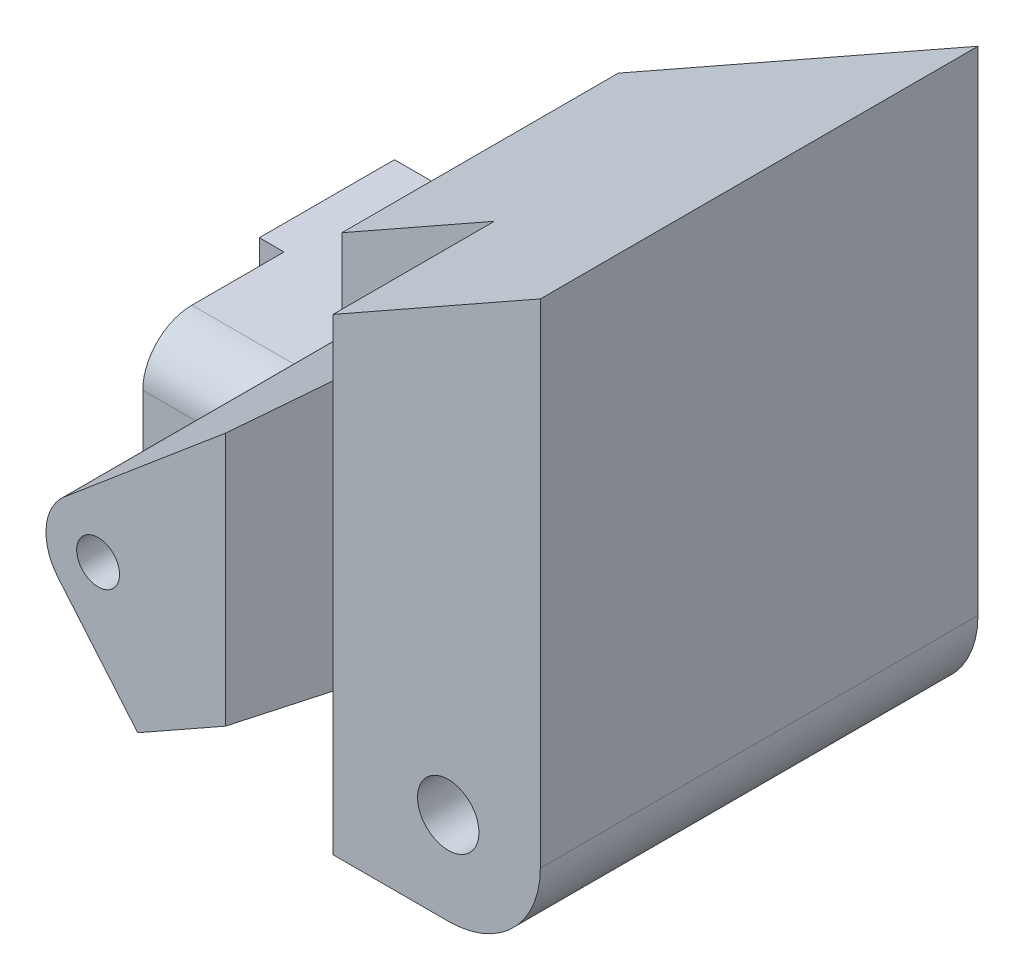
ISO-10303-21;
HEADER;
FILE_DESCRIPTION(('STEP AP214'),'2;1');
FILE_NAME('part.step','',(''),(''),'','','');
FILE_SCHEMA(('AUTOMOTIVE_DESIGN { 1 0 10303 214 1 1 1 1 }'));
ENDSEC;
DATA;
#1=APPLICATION_CONTEXT('core data for automotive mechanical design processes');
#2=APPLICATION_PROTOCOL_DEFINITION('international standard','automotive_design',2000,#1);
#3=PRODUCT_CONTEXT('',#1,'mechanical');
#4=PRODUCT('Part','Part','',(#3));
#5=PRODUCT_RELATED_PRODUCT_CATEGORY('part','',(#4));
#6=PRODUCT_DEFINITION_FORMATION('','',#4);
#7=PRODUCT_DEFINITION_CONTEXT('part definition',#1,'design');
#8=PRODUCT_DEFINITION('design','',#6,#7);
#9=PRODUCT_DEFINITION_SHAPE('','',#8);
#10=(LENGTH_UNIT() NAMED_UNIT(*) SI_UNIT(.MILLI.,.METRE.));
#11=(NAMED_UNIT(*) PLANE_ANGLE_UNIT() SI_UNIT($,.RADIAN.));
#12=(NAMED_UNIT(*) SI_UNIT($,.STERADIAN.) SOLID_ANGLE_UNIT());
#13=UNCERTAINTY_MEASURE_WITH_UNIT(LENGTH_MEASURE(1.E-05),#10,'distance_accuracy_value','');
#14=(GEOMETRIC_REPRESENTATION_CONTEXT(3) GLOBAL_UNCERTAINTY_ASSIGNED_CONTEXT((#13)) GLOBAL_UNIT_ASSIGNED_CONTEXT((#10,
#11,#12)) REPRESENTATION_CONTEXT('',''));
#15=CARTESIAN_POINT('',(0.,0.,0.));
#16=DIRECTION('',(0.,0.,1.));
#17=DIRECTION('',(1.,0.,0.));
#18=AXIS2_PLACEMENT_3D('',#15,#16,#17);
#19=CARTESIAN_POINT('',(-16.,0.,9.));
#20=DIRECTION('',(1.,0.,0.));
#21=DIRECTION('',(0.,0.,-1.));
#22=AXIS2_PLACEMENT_3D('',#19,#20,#21);
#23=PLANE('',#22);
#24=DIRECTION('',(0.,-1.,0.));
#25=VECTOR('',#24,1.);
#26=CARTESIAN_POINT('',(-16.,0.,-0.2));
#27=LINE('',#26,#25);
#28=CARTESIAN_POINT('',(-16.,-9.35000000000001,-0.2));
#29=VERTEX_POINT('',#28);
#30=CARTESIAN_POINT('',(-16.,-22.05,-0.200000000000001));
#31=VERTEX_POINT('',#30);
#32=EDGE_CURVE('E193',#29,#31,#27,.T.);
#33=ORIENTED_EDGE('',*,*,#32,.F.);
#34=DIRECTION('',(0.,0.,-1.));
#35=VECTOR('',#34,1.);
#36=CARTESIAN_POINT('',(-16.,-9.35000000000001,9.));
#37=LINE('',#36,#35);
#38=CARTESIAN_POINT('',(-16.,-9.35000000000001,-9.));
#39=VERTEX_POINT('',#38);
#40=EDGE_CURVE('E317',#29,#39,#37,.T.);
#41=ORIENTED_EDGE('',*,*,#40,.T.);
#42=DIRECTION('',(0.,-1.,0.));
#43=VECTOR('',#42,1.);
#44=CARTESIAN_POINT('',(-16.,0.,-9.));
#45=LINE('',#44,#43);
#46=CARTESIAN_POINT('',(-16.,-22.05,-9.));
#47=VERTEX_POINT('',#46);
#48=EDGE_CURVE('E288',#39,#47,#45,.T.);
#49=ORIENTED_EDGE('',*,*,#48,.T.);
#50=DIRECTION('',(0.,0.,-1.));
#51=VECTOR('',#50,1.);
#52=CARTESIAN_POINT('',(-16.,-22.05,9.));
#53=LINE('',#52,#51);
#54=EDGE_CURVE('E315',#31,#47,#53,.T.);
#55=ORIENTED_EDGE('',*,*,#54,.F.);
#56=EDGE_LOOP('',(#33,#41,#49,#55));
#57=FACE_BOUND('',#56,.T.);
#58=ADVANCED_FACE('F37',(#57),#23,.F.);
#59=CARTESIAN_POINT('',(0.,0.,9.));
#60=DIRECTION('',(0.,0.,1.));
#61=DIRECTION('',(1.,0.,0.));
#62=AXIS2_PLACEMENT_3D('',#59,#60,#61);
#63=PLANE('',#62);
#64=DIRECTION('',(-0.644238518166647,0.764824641150142,0.));
#65=VECTOR('',#64,1.);
#66=CARTESIAN_POINT('',(-9.30641295802667,-7.83911680004175,9.));
#67=LINE('',#66,#65);
#68=CARTESIAN_POINT('',(-0.722784510357856,-18.0293962728321,9.));
#69=VERTEX_POINT('',#68);
#70=CARTESIAN_POINT('',(-5.33827144073282,-12.55,9.));
#71=VERTEX_POINT('',#70);
#72=EDGE_CURVE('E272',#69,#71,#67,.T.);
#73=ORIENTED_EDGE('',*,*,#72,.T.);
#74=DIRECTION('',(-1.,0.,0.));
#75=VECTOR('',#74,1.);
#76=CARTESIAN_POINT('',(-14.3916870159381,-12.55,9.));
#77=LINE('',#76,#75);
#78=CARTESIAN_POINT('',(-14.3916870159381,-12.55,9.));
#79=VERTEX_POINT('',#78);
#80=EDGE_CURVE('E330',#71,#79,#77,.T.);
#81=ORIENTED_EDGE('',*,*,#80,.T.);
#82=DIRECTION('',(0.,1.,0.));
#83=VECTOR('',#82,1.);
#84=CARTESIAN_POINT('',(-14.3916870159381,0.,9.));
#85=LINE('',#84,#83);
#86=CARTESIAN_POINT('',(-14.3916870159381,-18.85,9.));
#87=VERTEX_POINT('',#86);
#88=EDGE_CURVE('E205',#87,#79,#85,.T.);
#89=ORIENTED_EDGE('',*,*,#88,.F.);
#90=DIRECTION('',(1.,0.,0.));
#91=VECTOR('',#90,1.);
#92=CARTESIAN_POINT('',(8.5,-18.85,9.));
#93=LINE('',#92,#91);
#94=CARTESIAN_POINT('',(8.5,-18.85,9.));
#95=VERTEX_POINT('',#94);
#96=EDGE_CURVE('E184',#87,#95,#93,.T.);
#97=ORIENTED_EDGE('',*,*,#96,.T.);
#98=DIRECTION('',(0.,1.,0.));
#99=VECTOR('',#98,1.);
#100=CARTESIAN_POINT('',(8.5,0.,9.));
#101=LINE('',#100,#99);
#102=CARTESIAN_POINT('',(8.5,-12.8207309978882,9.));
#103=VERTEX_POINT('',#102);
#104=EDGE_CURVE('E230',#95,#103,#101,.T.);
#105=ORIENTED_EDGE('',*,*,#104,.T.);
#106=DIRECTION('',(-0.870733168126101,-0.491755782807974,0.));
#107=VECTOR('',#106,1.);
#108=CARTESIAN_POINT('',(7.54518594542443,-13.3599723522222,9.));
#109=LINE('',#108,#107);
#110=EDGE_CURVE('E269',#103,#69,#109,.T.);
#111=ORIENTED_EDGE('',*,*,#110,.T.);
#112=EDGE_LOOP('',(#73,#81,#89,#97,#105,#111));
#113=FACE_BOUND('',#112,.T.);
#114=ADVANCED_FACE('F368',(#113),#63,.T.);
#115=DIRECTION('',(0.764824641150142,0.644238518166647,0.));
#116=VECTOR('',#115,1.);
#117=CARTESIAN_POINT('',(1.22264353214617,-1.45149331242928,9.));
#118=LINE('',#117,#116);
#119=CARTESIAN_POINT('',(-1.42439386884653,-3.68118540260928,9.));
#120=VERTEX_POINT('',#119);
#121=CARTESIAN_POINT('',(8.5,4.67847831083101,9.));
#122=VERTEX_POINT('',#121);
#123=EDGE_CURVE('E264',#120,#122,#118,.T.);
#124=ORIENTED_EDGE('',*,*,#123,.T.);
#125=CARTESIAN_POINT('',(8.5,8.42573195678906,9.));
#126=VERTEX_POINT('',#125);
#127=EDGE_CURVE('E229',#122,#126,#101,.T.);
#128=ORIENTED_EDGE('',*,*,#127,.T.);
#129=DIRECTION('',(-0.870733168126101,-0.491755782807974,0.));
#130=VECTOR('',#129,1.);
#131=CARTESIAN_POINT('',(-1.55229603652309,2.74859125811062,9.));
#132=LINE('',#131,#130);
#133=CARTESIAN_POINT('',(-1.42439386884653,2.8208253625309,9.));
#134=VERTEX_POINT('',#133);
#135=EDGE_CURVE('E276',#126,#134,#132,.T.);
#136=ORIENTED_EDGE('',*,*,#135,.T.);
#137=DIRECTION('',(0.,-1.,0.));
#138=VECTOR('',#137,1.);
#139=CARTESIAN_POINT('',(-1.42439386884653,0.,9.));
#140=LINE('',#139,#138);
#141=EDGE_CURVE('E278',#134,#120,#140,.T.);
#142=ORIENTED_EDGE('',*,*,#141,.T.);
#143=EDGE_LOOP('',(#124,#128,#136,#142));
#144=FACE_BOUND('',#143,.T.);
#145=ADVANCED_FACE('F391',(#144),#63,.T.);
#146=CARTESIAN_POINT('',(0.,-9.35000000000001,9.));
#147=DIRECTION('',(0.,-1.,0.));
#148=DIRECTION('',(1.,0.,0.));
#149=AXIS2_PLACEMENT_3D('',#146,#147,#148);
#150=PLANE('',#149);
#151=DIRECTION('',(0.,0.,-1.));
#152=VECTOR('',#151,1.);
#153=CARTESIAN_POINT('',(-14.3916870159381,-9.35000000000001,23.));
#154=LINE('',#153,#152);
#155=CARTESIAN_POINT('',(-14.3916870159381,-9.35000000000001,5.8));
#156=VERTEX_POINT('',#155);
#157=CARTESIAN_POINT('',(-14.3916870159381,-9.35000000000001,-0.2));
#158=VERTEX_POINT('',#157);
#159=EDGE_CURVE('E198',#156,#158,#154,.T.);
#160=ORIENTED_EDGE('',*,*,#159,.F.);
#161=DIRECTION('',(-1.,0.,0.));
#162=VECTOR('',#161,1.);
#163=CARTESIAN_POINT('',(-6.67691057032904,-9.35000000000001,5.8));
#164=LINE('',#163,#162);
#165=CARTESIAN_POINT('',(-6.67691057032904,-9.35000000000001,5.8));
#166=VERTEX_POINT('',#165);
#167=EDGE_CURVE('E337',#156,#166,#164,.F.);
#168=ORIENTED_EDGE('',*,*,#167,.T.);
#169=DIRECTION('',(0.,0.,-1.));
#170=VECTOR('',#169,1.);
#171=CARTESIAN_POINT('',(-6.67691057032904,-9.35000000000001,23.));
#172=LINE('',#171,#170);
#173=CARTESIAN_POINT('',(-6.67691057032904,-9.35000000000001,-9.));
#174=VERTEX_POINT('',#173);
#175=EDGE_CURVE('E261',#174,#166,#172,.F.);
#176=ORIENTED_EDGE('',*,*,#175,.F.);
#177=DIRECTION('',(-1.,0.,0.));
#178=VECTOR('',#177,1.);
#179=CARTESIAN_POINT('',(0.,-9.35000000000001,-9.));
#180=LINE('',#179,#178);
#181=EDGE_CURVE('E285',#174,#39,#180,.T.);
#182=ORIENTED_EDGE('',*,*,#181,.T.);
#183=ORIENTED_EDGE('',*,*,#40,.F.);
#184=DIRECTION('',(-1.,0.,0.));
#185=VECTOR('',#184,1.);
#186=CARTESIAN_POINT('',(0.,-9.35000000000001,-0.2));
#187=LINE('',#186,#185);
#188=EDGE_CURVE('E199',#158,#29,#187,.T.);
#189=ORIENTED_EDGE('',*,*,#188,.F.);
#190=EDGE_LOOP('',(#160,#168,#176,#182,#183,#189));
#191=FACE_BOUND('',#190,.T.);
#192=ADVANCED_FACE('F387',(#191),#150,.F.);
#193=CARTESIAN_POINT('',(-1.42439386884653,0.,9.));
#194=DIRECTION('',(1.,0.,0.));
#195=DIRECTION('',(0.,0.,-1.));
#196=AXIS2_PLACEMENT_3D('',#193,#194,#195);
#197=PLANE('',#196);
#198=DIRECTION('',(0.,0.,-1.));
#199=VECTOR('',#198,1.);
#200=CARTESIAN_POINT('',(-1.42439386884653,-3.68118540260928,9.));
#201=LINE('',#200,#199);
#202=CARTESIAN_POINT('',(-1.42439386884653,-3.68118540260928,-9.));
#203=VERTEX_POINT('',#202);
#204=EDGE_CURVE('E267',#120,#203,#201,.T.);
#205=ORIENTED_EDGE('',*,*,#204,.F.);
#206=ORIENTED_EDGE('',*,*,#141,.F.);
#207=DIRECTION('',(0.,0.,-1.));
#208=VECTOR('',#207,1.);
#209=CARTESIAN_POINT('',(-1.42439386884653,2.8208253625309,9.));
#210=LINE('',#209,#208);
#211=CARTESIAN_POINT('',(-1.42439386884653,2.8208253625309,-9.));
#212=VERTEX_POINT('',#211);
#213=EDGE_CURVE('E282',#134,#212,#210,.T.);
#214=ORIENTED_EDGE('',*,*,#213,.T.);
#215=DIRECTION('',(0.,-1.,0.));
#216=VECTOR('',#215,1.);
#217=CARTESIAN_POINT('',(-1.42439386884653,0.,-9.));
#218=LINE('',#217,#216);
#219=EDGE_CURVE('E299',#212,#203,#218,.T.);
#220=ORIENTED_EDGE('',*,*,#219,.T.);
#221=EDGE_LOOP('',(#205,#206,#214,#220));
#222=FACE_BOUND('',#221,.T.);
#223=ADVANCED_FACE('F364',(#222),#197,.F.);
#224=CARTESIAN_POINT('',(-3.3,-9.7,9.));
#225=DIRECTION('',(0.,0.,-1.));
#226=DIRECTION('',(-1.,0.,0.));
#227=AXIS2_PLACEMENT_3D('',#224,#225,#226);
#228=CYLINDRICAL_SURFACE('',#227,1.395);
#229=CARTESIAN_POINT('',(-3.3,-9.7,-9.));
#230=DIRECTION('',(0.,0.,1.));
#231=DIRECTION('',(1.,0.,0.));
#232=AXIS2_PLACEMENT_3D('',#229,#230,#231);
#233=CIRCLE('',#232,1.395);
#234=CARTESIAN_POINT('',(-1.905,-9.7,-9.));
#235=VERTEX_POINT('',#234);
#236=EDGE_CURVE('E275',#235,#235,#233,.T.);
#237=ORIENTED_EDGE('',*,*,#236,.F.);
#238=EDGE_LOOP('',(#237));
#239=FACE_BOUND('',#238,.T.);
#240=CARTESIAN_POINT('',(-3.3,-9.7,23.));
#241=DIRECTION('',(0.,0.,1.));
#242=DIRECTION('',(1.,0.,0.));
#243=AXIS2_PLACEMENT_3D('',#240,#241,#242);
#244=CIRCLE('',#243,1.395);
#245=CARTESIAN_POINT('',(-1.905,-9.7,23.));
#246=VERTEX_POINT('',#245);
#247=EDGE_CURVE('E232',#246,#246,#244,.T.);
#248=ORIENTED_EDGE('',*,*,#247,.T.);
#249=EDGE_LOOP('',(#248));
#250=FACE_BOUND('',#249,.T.);
#251=ADVANCED_FACE('F361',(#239,#250),#228,.F.);
#252=CARTESIAN_POINT('',(0.,-22.05,9.));
#253=DIRECTION('',(0.,1.,0.));
#254=DIRECTION('',(0.,0.,1.));
#255=AXIS2_PLACEMENT_3D('',#252,#253,#254);
#256=PLANE('',#255);
#257=DIRECTION('',(0.,0.,-1.));
#258=VECTOR('',#257,1.);
#259=CARTESIAN_POINT('',(8.5,-22.05,19.5));
#260=LINE('',#259,#258);
#261=CARTESIAN_POINT('',(8.5,-22.05,19.5));
#262=VERTEX_POINT('',#261);
#263=CARTESIAN_POINT('',(8.5,-22.05,5.8));
#264=VERTEX_POINT('',#263);
#265=EDGE_CURVE('E60',#262,#264,#260,.T.);
#266=ORIENTED_EDGE('',*,*,#265,.T.);
#267=DIRECTION('',(1.,0.,0.));
#268=VECTOR('',#267,1.);
#269=CARTESIAN_POINT('',(-14.3916870159381,-22.05,5.8));
#270=LINE('',#269,#268);
#271=CARTESIAN_POINT('',(-14.3916870159381,-22.05,5.8));
#272=VERTEX_POINT('',#271);
#273=EDGE_CURVE('E180',#264,#272,#270,.F.);
#274=ORIENTED_EDGE('',*,*,#273,.T.);
#275=DIRECTION('',(0.,0.,-1.));
#276=VECTOR('',#275,1.);
#277=CARTESIAN_POINT('',(-14.3916870159381,-22.05,9.));
#278=LINE('',#277,#276);
#279=CARTESIAN_POINT('',(-14.3916870159381,-22.05,-0.2));
#280=VERTEX_POINT('',#279);
#281=EDGE_CURVE('E174',#272,#280,#278,.T.);
#282=ORIENTED_EDGE('',*,*,#281,.T.);
#283=DIRECTION('',(1.,0.,0.));
#284=VECTOR('',#283,1.);
#285=CARTESIAN_POINT('',(0.,-22.05,-0.2));
#286=LINE('',#285,#284);
#287=EDGE_CURVE('E177',#31,#280,#286,.T.);
#288=ORIENTED_EDGE('',*,*,#287,.F.);
#289=ORIENTED_EDGE('',*,*,#54,.T.);
#290=DIRECTION('',(1.,0.,0.));
#291=VECTOR('',#290,1.);
#292=CARTESIAN_POINT('',(0.,-22.05,-9.));
#293=LINE('',#292,#291);
#294=CARTESIAN_POINT('',(16.,-22.05,-9.));
#295=VERTEX_POINT('',#294);
#296=EDGE_CURVE('E291',#47,#295,#293,.T.);
#297=ORIENTED_EDGE('',*,*,#296,.T.);
#298=DIRECTION('',(0.,0.,-1.));
#299=VECTOR('',#298,1.);
#300=CARTESIAN_POINT('',(16.,-22.05,9.));
#301=LINE('',#300,#299);
#302=CARTESIAN_POINT('',(16.,-22.05,19.5));
#303=VERTEX_POINT('',#302);
#304=EDGE_CURVE('E312',#303,#295,#301,.T.);
#305=ORIENTED_EDGE('',*,*,#304,.F.);
#306=DIRECTION('',(1.,0.,0.));
#307=VECTOR('',#306,1.);
#308=CARTESIAN_POINT('',(0.,-22.05,19.5));
#309=LINE('',#308,#307);
#310=EDGE_CURVE('E222',#262,#303,#309,.T.);
#311=ORIENTED_EDGE('',*,*,#310,.F.);
#312=EDGE_LOOP('',(#266,#274,#282,#288,#289,#297,#305,#311));
#313=FACE_BOUND('',#312,.T.);
#314=ADVANCED_FACE('F176',(#313),#256,.F.);
#315=CARTESIAN_POINT('',(16.,-16.05,9.));
#316=DIRECTION('',(0.,0.,-1.));
#317=DIRECTION('',(-1.,0.,0.));
#318=AXIS2_PLACEMENT_3D('',#315,#316,#317);
#319=CYLINDRICAL_SURFACE('',#318,6.);
#320=CARTESIAN_POINT('',(16.,-16.05,-9.));
#321=DIRECTION('',(0.,0.,1.));
#322=DIRECTION('',(1.,0.,0.));
#323=AXIS2_PLACEMENT_3D('',#320,#321,#322);
#324=CIRCLE('',#323,6.);
#325=CARTESIAN_POINT('',(22.,-16.05,-9.));
#326=VERTEX_POINT('',#325);
#327=EDGE_CURVE('E293',#295,#326,#324,.T.);
#328=ORIENTED_EDGE('',*,*,#327,.T.);
#329=DIRECTION('',(0.,0.,-1.));
#330=VECTOR('',#329,1.);
#331=CARTESIAN_POINT('',(22.,-16.05,9.));
#332=LINE('',#331,#330);
#333=CARTESIAN_POINT('',(22.,-16.05,19.5));
#334=VERTEX_POINT('',#333);
#335=EDGE_CURVE('E309',#334,#326,#332,.T.);
#336=ORIENTED_EDGE('',*,*,#335,.F.);
#337=CARTESIAN_POINT('',(16.,-16.05,19.5));
#338=DIRECTION('',(0.,0.,1.));
#339=DIRECTION('',(1.,0.,0.));
#340=AXIS2_PLACEMENT_3D('',#337,#338,#339);
#341=CIRCLE('',#340,6.);
#342=EDGE_CURVE('E210',#303,#334,#341,.T.);
#343=ORIENTED_EDGE('',*,*,#342,.F.);
#344=ORIENTED_EDGE('',*,*,#304,.T.);
#345=EDGE_LOOP('',(#328,#336,#343,#344));
#346=FACE_BOUND('',#345,.T.);
#347=ADVANCED_FACE('F372',(#346),#319,.T.);
#348=CARTESIAN_POINT('',(22.,0.,9.));
#349=DIRECTION('',(-1.,0.,0.));
#350=DIRECTION('',(0.,0.,1.));
#351=AXIS2_PLACEMENT_3D('',#348,#349,#350);
#352=PLANE('',#351);
#353=DIRECTION('',(0.,1.,0.));
#354=VECTOR('',#353,1.);
#355=CARTESIAN_POINT('',(22.,0.,-9.));
#356=LINE('',#355,#354);
#357=CARTESIAN_POINT('',(22.,16.05,-9.));
#358=VERTEX_POINT('',#357);
#359=EDGE_CURVE('E295',#326,#358,#356,.T.);
#360=ORIENTED_EDGE('',*,*,#359,.T.);
#361=DIRECTION('',(0.,0.,-1.));
#362=VECTOR('',#361,1.);
#363=CARTESIAN_POINT('',(22.,16.05,9.));
#364=LINE('',#363,#362);
#365=CARTESIAN_POINT('',(22.,16.05,19.5));
#366=VERTEX_POINT('',#365);
#367=EDGE_CURVE('E306',#366,#358,#364,.T.);
#368=ORIENTED_EDGE('',*,*,#367,.F.);
#369=DIRECTION('',(0.,1.,0.));
#370=VECTOR('',#369,1.);
#371=CARTESIAN_POINT('',(22.,0.,19.5));
#372=LINE('',#371,#370);
#373=EDGE_CURVE('E213',#334,#366,#372,.T.);
#374=ORIENTED_EDGE('',*,*,#373,.F.);
#375=ORIENTED_EDGE('',*,*,#335,.T.);
#376=EDGE_LOOP('',(#360,#368,#374,#375));
#377=FACE_BOUND('',#376,.T.);
#378=ADVANCED_FACE('F375',(#377),#352,.F.);
#379=CARTESIAN_POINT('',(-1.55229603652309,2.74859125811062,9.));
#380=DIRECTION('',(0.491755782807974,-0.870733168126101,0.));
#381=DIRECTION('',(0.870733168126101,0.491755782807974,0.));
#382=AXIS2_PLACEMENT_3D('',#379,#380,#381);
#383=PLANE('',#382);
#384=DIRECTION('',(-0.870733168126101,-0.491755782807974,0.));
#385=VECTOR('',#384,1.);
#386=CARTESIAN_POINT('',(-1.55229603652309,2.74859125811062,-9.));
#387=LINE('',#386,#385);
#388=EDGE_CURVE('E297',#358,#212,#387,.T.);
#389=ORIENTED_EDGE('',*,*,#388,.T.);
#390=ORIENTED_EDGE('',*,*,#213,.F.);
#391=ORIENTED_EDGE('',*,*,#135,.F.);
#392=DIRECTION('',(0.,0.,-1.));
#393=VECTOR('',#392,1.);
#394=CARTESIAN_POINT('',(8.5,8.42573195678906,19.5));
#395=LINE('',#394,#393);
#396=CARTESIAN_POINT('',(8.5,8.42573195678906,19.5));
#397=VERTEX_POINT('',#396);
#398=EDGE_CURVE('E226',#397,#126,#395,.T.);
#399=ORIENTED_EDGE('',*,*,#398,.F.);
#400=DIRECTION('',(-0.870733168126101,-0.491755782807974,0.));
#401=VECTOR('',#400,1.);
#402=CARTESIAN_POINT('',(-1.55229603652309,2.74859125811062,19.5));
#403=LINE('',#402,#401);
#404=EDGE_CURVE('E216',#366,#397,#403,.T.);
#405=ORIENTED_EDGE('',*,*,#404,.F.);
#406=ORIENTED_EDGE('',*,*,#367,.T.);
#407=EDGE_LOOP('',(#389,#390,#391,#399,#405,#406));
#408=FACE_BOUND('',#407,.T.);
#409=ADVANCED_FACE('F379',(#408),#383,.F.);
#410=CARTESIAN_POINT('',(16.,-16.05,9.));
#411=DIRECTION('',(0.,0.,-1.));
#412=DIRECTION('',(-1.,0.,0.));
#413=AXIS2_PLACEMENT_3D('',#410,#411,#412);
#414=CYLINDRICAL_SURFACE('',#413,2.);
#415=CARTESIAN_POINT('',(16.,-16.05,-9.));
#416=DIRECTION('',(0.,0.,1.));
#417=DIRECTION('',(1.,0.,0.));
#418=AXIS2_PLACEMENT_3D('',#415,#416,#417);
#419=CIRCLE('',#418,2.);
#420=CARTESIAN_POINT('',(18.,-16.05,-9.));
#421=VERTEX_POINT('',#420);
#422=EDGE_CURVE('E279',#421,#421,#419,.T.);
#423=ORIENTED_EDGE('',*,*,#422,.F.);
#424=EDGE_LOOP('',(#423));
#425=FACE_BOUND('',#424,.T.);
#426=CARTESIAN_POINT('',(16.,-16.05,19.5));
#427=DIRECTION('',(0.,0.,1.));
#428=DIRECTION('',(1.,0.,0.));
#429=AXIS2_PLACEMENT_3D('',#426,#427,#428);
#430=CIRCLE('',#429,2.);
#431=CARTESIAN_POINT('',(18.,-16.05,19.5));
#432=VERTEX_POINT('',#431);
#433=EDGE_CURVE('E207',#432,#432,#430,.T.);
#434=ORIENTED_EDGE('',*,*,#433,.T.);
#435=EDGE_LOOP('',(#434));
#436=FACE_BOUND('',#435,.T.);
#437=ADVANCED_FACE('F383',(#425,#436),#414,.F.);
#438=CARTESIAN_POINT('',(0.,0.,-9.));
#439=DIRECTION('',(0.,0.,1.));
#440=DIRECTION('',(1.,0.,0.));
#441=AXIS2_PLACEMENT_3D('',#438,#439,#440);
#442=PLANE('',#441);
#443=ORIENTED_EDGE('',*,*,#327,.F.);
#444=ORIENTED_EDGE('',*,*,#296,.F.);
#445=ORIENTED_EDGE('',*,*,#48,.F.);
#446=ORIENTED_EDGE('',*,*,#181,.F.);
#447=CARTESIAN_POINT('',(-3.3,-9.7,-9.));
#448=DIRECTION('',(0.,0.,1.));
#449=DIRECTION('',(1.,0.,0.));
#450=AXIS2_PLACEMENT_3D('',#447,#448,#449);
#451=CIRCLE('',#450,3.395);
#452=CARTESIAN_POINT('',(-5.48718976917577,-7.10342034329527,-9.));
#453=VERTEX_POINT('',#452);
#454=EDGE_CURVE('E240',#453,#174,#451,.T.);
#455=ORIENTED_EDGE('',*,*,#454,.F.);
#456=DIRECTION('',(-0.764824641150142,-0.644238518166647,0.));
#457=VECTOR('',#456,1.);
#458=CARTESIAN_POINT('',(1.22264353214617,-1.45149331242928,-9.));
#459=LINE('',#458,#457);
#460=EDGE_CURVE('E235',#203,#453,#459,.T.);
#461=ORIENTED_EDGE('',*,*,#460,.F.);
#462=ORIENTED_EDGE('',*,*,#219,.F.);
#463=ORIENTED_EDGE('',*,*,#388,.F.);
#464=ORIENTED_EDGE('',*,*,#359,.F.);
#465=EDGE_LOOP('',(#443,#444,#445,#446,#455,#461,#462,#463,#464));
#466=FACE_BOUND('',#465,.T.);
#467=ORIENTED_EDGE('',*,*,#422,.T.);
#468=EDGE_LOOP('',(#467));
#469=FACE_BOUND('',#468,.T.);
#470=ORIENTED_EDGE('',*,*,#236,.T.);
#471=EDGE_LOOP('',(#470));
#472=FACE_BOUND('',#471,.T.);
#473=ADVANCED_FACE('F395',(#466,#469,#472),#442,.F.);
#474=CARTESIAN_POINT('',(1.22264353214617,-1.45149331242928,23.));
#475=DIRECTION('',(0.644238518166647,-0.764824641150142,0.));
#476=DIRECTION('',(0.764824641150142,0.644238518166647,0.));
#477=AXIS2_PLACEMENT_3D('',#474,#475,#476);
#478=PLANE('',#477);
#479=DIRECTION('',(-0.764824641150142,-0.644238518166647,0.));
#480=VECTOR('',#479,1.);
#481=CARTESIAN_POINT('',(1.22264353214617,-1.45149331242928,23.));
#482=LINE('',#481,#480);
#483=CARTESIAN_POINT('',(5.00000000000001,1.73030602104647,23.));
#484=VERTEX_POINT('',#483);
#485=CARTESIAN_POINT('',(-5.48718976917577,-7.10342034329527,23.));
#486=VERTEX_POINT('',#485);
#487=EDGE_CURVE('E243',#484,#486,#482,.T.);
#488=ORIENTED_EDGE('',*,*,#487,.F.);
#489=DIRECTION('',(0.607509629501054,0.511726587277797,-0.607509629501057));
#490=VECTOR('',#489,1.);
#491=CARTESIAN_POINT('',(1.44655984400211,-1.26288077933087,26.5534401559979));
#492=LINE('',#491,#490);
#493=CARTESIAN_POINT('',(8.5,4.67847831083101,19.5));
#494=VERTEX_POINT('',#493);
#495=EDGE_CURVE('E322',#484,#494,#492,.T.);
#496=ORIENTED_EDGE('',*,*,#495,.T.);
#497=DIRECTION('',(0.,0.,-1.));
#498=VECTOR('',#497,1.);
#499=CARTESIAN_POINT('',(8.5,4.67847831083101,23.));
#500=LINE('',#499,#498);
#501=EDGE_CURVE('E253',#494,#122,#500,.T.);
#502=ORIENTED_EDGE('',*,*,#501,.T.);
#503=ORIENTED_EDGE('',*,*,#123,.F.);
#504=ORIENTED_EDGE('',*,*,#204,.T.);
#505=ORIENTED_EDGE('',*,*,#460,.T.);
#506=DIRECTION('',(0.,0.,-1.));
#507=VECTOR('',#506,1.);
#508=CARTESIAN_POINT('',(-5.48718976917577,-7.10342034329527,23.));
#509=LINE('',#508,#507);
#510=EDGE_CURVE('E250',#486,#453,#509,.T.);
#511=ORIENTED_EDGE('',*,*,#510,.F.);
#512=EDGE_LOOP('',(#488,#496,#502,#503,#504,#505,#511));
#513=FACE_BOUND('',#512,.T.);
#514=ADVANCED_FACE('F399',(#513),#478,.F.);
#515=CARTESIAN_POINT('',(-3.3,-9.7,23.));
#516=DIRECTION('',(0.,0.,-1.));
#517=DIRECTION('',(-1.,0.,0.));
#518=AXIS2_PLACEMENT_3D('',#515,#516,#517);
#519=CYLINDRICAL_SURFACE('',#518,3.395);
#520=ORIENTED_EDGE('',*,*,#454,.T.);
#521=ORIENTED_EDGE('',*,*,#175,.T.);
#522=CARTESIAN_POINT('',(-6.67691057032904,-9.35000000000001,5.8));
#523=CARTESIAN_POINT('',(-6.67688258005714,-9.34999024908477,5.88978760159597));
#524=CARTESIAN_POINT('',(-6.677301391759,-9.35377854973839,5.97957207960525));
#525=CARTESIAN_POINT('',(-6.67882975938434,-9.36887967207185,6.15849097230396));
#526=CARTESIAN_POINT('',(-6.67993924195429,-9.38019169469439,6.24762545500998));
#527=CARTESIAN_POINT('',(-6.68264662218954,-9.41027371151528,6.42464932962566));
#528=CARTESIAN_POINT('',(-6.68424468226906,-9.42904618636002,6.51253829731685));
#529=CARTESIAN_POINT('',(-6.6875387222798,-9.47391304525261,6.68642565316253));
#530=CARTESIAN_POINT('',(-6.68923470303408,-9.50000749085078,6.77242402541764));
#531=CARTESIAN_POINT('',(-6.69221539001444,-9.55935394120288,6.94197558064144));
#532=CARTESIAN_POINT('',(-6.69349987168857,-9.59260983741233,7.02552740603074));
#533=CARTESIAN_POINT('',(-6.69502864355835,-9.66603741335418,7.1895439236018));
#534=CARTESIAN_POINT('',(-6.69527297241094,-9.70620883601563,7.27000873040144));
#535=CARTESIAN_POINT('',(-6.6939995243153,-9.79318414632693,7.42728057378627));
#536=CARTESIAN_POINT('',(-6.69248142266241,-9.83998925475122,7.50408693363634));
#537=CARTESIAN_POINT('',(-6.68688736259939,-9.93982501137579,7.65338741784205));
#538=CARTESIAN_POINT('',(-6.68281289982761,-9.99285200462893,7.72588403654569));
#539=CARTESIAN_POINT('',(-6.67138425608695,-10.1035115407525,7.86455775654226));
#540=CARTESIAN_POINT('',(-6.66409970902002,-10.1610260314129,7.93083460571862));
#541=CARTESIAN_POINT('',(-6.64547238673695,-10.2809635547135,8.05812187485913));
#542=CARTESIAN_POINT('',(-6.63413173312726,-10.3433840079243,8.11913502740764));
#543=CARTESIAN_POINT('',(-6.6066398234655,-10.4723324687631,8.23532758189984));
#544=CARTESIAN_POINT('',(-6.59049407552353,-10.5388557044983,8.29051356595878));
#545=CARTESIAN_POINT('',(-6.55271088106227,-10.6751368258968,8.39465564930571));
#546=CARTESIAN_POINT('',(-6.53107453097153,-10.7448940634858,8.44361298947621));
#547=CARTESIAN_POINT('',(-6.48490118859393,-10.8775921183883,8.52918979596621));
#548=CARTESIAN_POINT('',(-6.46107584889973,-10.9402808904746,8.56658658285294));
#549=CARTESIAN_POINT('',(-6.40860549166726,-11.0664787627355,8.63625770893206));
#550=CARTESIAN_POINT('',(-6.37996099344202,-11.129987773841,8.66853259933311));
#551=CARTESIAN_POINT('',(-6.31775706384659,-11.2569729714737,8.72796789684883));
#552=CARTESIAN_POINT('',(-6.28419847464659,-11.3204491617587,8.75512917850731));
#553=CARTESIAN_POINT('',(-6.21220514335332,-11.4465263912017,8.80448464542872));
#554=CARTESIAN_POINT('',(-6.17377222881122,-11.5091277486482,8.82668068375479));
#555=CARTESIAN_POINT('',(-6.09707455975236,-11.6252633298086,8.86400420290536));
#556=CARTESIAN_POINT('',(-6.05934459563841,-11.6789831387544,8.87966058214665));
#557=CARTESIAN_POINT('',(-5.98048424546324,-11.7845574481533,8.90758440734938));
#558=CARTESIAN_POINT('',(-5.93936295625589,-11.8364164355722,8.91986055934601));
#559=CARTESIAN_POINT('',(-5.89657965670474,-11.8871897691758,8.93060419055407));
#560=B_SPLINE_CURVE_WITH_KNOTS('',3,(#522,#523,#524,#525,#526,#527,#528,#529,#530,#531,#532,
#533,#534,#535,#536,#537,#538,#539,#540,#541,#542,#543,#544,#545,#546,#547,#548,#549,#550,#551,
#552,#553,#554,#555,#556,#557,#558,#559),.UNSPECIFIED.,.F.,.F.,(4,2,2,2,2,2,2,2,2,2,2,2,2,2,2,2,
2,2,4),(0.,0.269277198732523,0.538525803431094,0.807864009957091,1.07720448067535,
1.34669167910218,1.61616886204035,1.88569570048661,2.15506499497498,2.4188585115523,
2.68251424834311,2.94586891143199,3.20917102606437,3.43921288663405,3.6692299737274,
3.89920768684224,4.12909942695829,4.3313652021454,4.53310504682456),.UNSPECIFIED.);
#561=CARTESIAN_POINT('',(-5.89657965670474,-11.8871897691758,8.93060419055407));
#562=VERTEX_POINT('',#561);
#563=EDGE_CURVE('E340',#166,#562,#560,.T.);
#564=ORIENTED_EDGE('',*,*,#563,.T.);
#565=DIRECTION('',(0.,0.,-1.));
#566=VECTOR('',#565,1.);
#567=CARTESIAN_POINT('',(-5.89657965670474,-11.8871897691758,23.));
#568=LINE('',#567,#566);
#569=CARTESIAN_POINT('',(-5.89657965670474,-11.8871897691758,23.));
#570=VERTEX_POINT('',#569);
#571=EDGE_CURVE('E52',#570,#562,#568,.T.);
#572=ORIENTED_EDGE('',*,*,#571,.F.);
#573=CARTESIAN_POINT('',(-3.3,-9.7,23.));
#574=DIRECTION('',(0.,0.,1.));
#575=DIRECTION('',(1.,0.,0.));
#576=AXIS2_PLACEMENT_3D('',#573,#574,#575);
#577=CIRCLE('',#576,3.395);
#578=EDGE_CURVE('E245',#486,#570,#577,.T.);
#579=ORIENTED_EDGE('',*,*,#578,.F.);
#580=ORIENTED_EDGE('',*,*,#510,.T.);
#581=EDGE_LOOP('',(#520,#521,#564,#572,#579,#580));
#582=FACE_BOUND('',#581,.T.);
#583=ADVANCED_FACE('F346',(#582),#519,.T.);
#584=CARTESIAN_POINT('',(-3.3,-9.7,23.));
#585=DIRECTION('',(0.,0.,1.));
#586=DIRECTION('',(1.,0.,0.));
#587=AXIS2_PLACEMENT_3D('',#584,#585,#586);
#588=PLANE('',#587);
#589=DIRECTION('',(0.870733168126101,0.491755782807974,0.));
#590=VECTOR('',#589,1.);
#591=CARTESIAN_POINT('',(7.54518594542443,-13.3599723522222,23.));
#592=LINE('',#591,#590);
#593=CARTESIAN_POINT('',(-0.722784510357856,-18.0293962728321,23.));
#594=VERTEX_POINT('',#593);
#595=CARTESIAN_POINT('',(5.00000000000001,-14.7973930831651,23.));
#596=VERTEX_POINT('',#595);
#597=EDGE_CURVE('E239',#594,#596,#592,.T.);
#598=ORIENTED_EDGE('',*,*,#597,.T.);
#599=DIRECTION('',(0.,1.,0.));
#600=VECTOR('',#599,1.);
#601=CARTESIAN_POINT('',(5.00000000000001,4.67847831083101,23.));
#602=LINE('',#601,#600);
#603=EDGE_CURVE('E319',#596,#484,#602,.T.);
#604=ORIENTED_EDGE('',*,*,#603,.T.);
#605=ORIENTED_EDGE('',*,*,#487,.T.);
#606=ORIENTED_EDGE('',*,*,#578,.T.);
#607=DIRECTION('',(0.644238518166647,-0.764824641150142,0.));
#608=VECTOR('',#607,1.);
#609=CARTESIAN_POINT('',(-9.30641295802667,-7.83911680004175,23.));
#610=LINE('',#609,#608);
#611=EDGE_CURVE('E236',#570,#594,#610,.T.);
#612=ORIENTED_EDGE('',*,*,#611,.T.);
#613=EDGE_LOOP('',(#598,#604,#605,#606,#612));
#614=FACE_BOUND('',#613,.T.);
#615=ORIENTED_EDGE('',*,*,#247,.F.);
#616=EDGE_LOOP('',(#615));
#617=FACE_BOUND('',#616,.T.);
#618=ADVANCED_FACE('F407',(#614,#617),#588,.T.);
#619=CARTESIAN_POINT('',(-9.30641295802667,-7.83911680004175,23.));
#620=DIRECTION('',(0.764824641150142,0.644238518166647,0.));
#621=DIRECTION('',(-0.644238518166647,0.764824641150142,0.));
#622=AXIS2_PLACEMENT_3D('',#619,#620,#621);
#623=PLANE('',#622);
#624=ORIENTED_EDGE('',*,*,#72,.F.);
#625=DIRECTION('',(0.,0.,-1.));
#626=VECTOR('',#625,1.);
#627=CARTESIAN_POINT('',(-0.722784510357856,-18.0293962728321,23.));
#628=LINE('',#627,#626);
#629=EDGE_CURVE('E258',#594,#69,#628,.T.);
#630=ORIENTED_EDGE('',*,*,#629,.F.);
#631=ORIENTED_EDGE('',*,*,#611,.F.);
#632=ORIENTED_EDGE('',*,*,#571,.T.);
#633=CARTESIAN_POINT('',(-5.33827144073281,-12.55,5.8));
#634=DIRECTION('',(0.764824641150142,0.644238518166647,0.));
#635=DIRECTION('',(0.644238518166647,-0.764824641150142,0.));
#636=AXIS2_PLACEMENT_3D('',#633,#634,#635);
#637=ELLIPSE('',#636,4.18396561489944,3.2);
#638=EDGE_CURVE('E45',#562,#71,#637,.T.);
#639=ORIENTED_EDGE('',*,*,#638,.T.);
#640=EDGE_LOOP('',(#624,#630,#631,#632,#639));
#641=FACE_BOUND('',#640,.T.);
#642=ADVANCED_FACE('F404',(#641),#623,.F.);
#643=CARTESIAN_POINT('',(7.54518594542443,-13.3599723522222,23.));
#644=DIRECTION('',(-0.491755782807974,0.870733168126101,0.));
#645=DIRECTION('',(-0.870733168126101,-0.491755782807974,0.));
#646=AXIS2_PLACEMENT_3D('',#643,#644,#645);
#647=PLANE('',#646);
#648=DIRECTION('',(0.,0.,-1.));
#649=VECTOR('',#648,1.);
#650=CARTESIAN_POINT('',(8.5,-12.8207309978882,23.));
#651=LINE('',#650,#649);
#652=CARTESIAN_POINT('',(8.5,-12.8207309978882,19.5));
#653=VERTEX_POINT('',#652);
#654=EDGE_CURVE('E255',#653,#103,#651,.T.);
#655=ORIENTED_EDGE('',*,*,#654,.F.);
#656=DIRECTION('',(-0.65668014196703,-0.370867068222996,0.656680141967032));
#657=VECTOR('',#656,1.);
#658=CARTESIAN_POINT('',(6.24142440772445,-14.0962854950262,21.7585755922756));
#659=LINE('',#658,#657);
#660=EDGE_CURVE('E185',#653,#596,#659,.T.);
#661=ORIENTED_EDGE('',*,*,#660,.T.);
#662=ORIENTED_EDGE('',*,*,#597,.F.);
#663=ORIENTED_EDGE('',*,*,#629,.T.);
#664=ORIENTED_EDGE('',*,*,#110,.F.);
#665=EDGE_LOOP('',(#655,#661,#662,#663,#664));
#666=FACE_BOUND('',#665,.T.);
#667=ADVANCED_FACE('F359',(#666),#647,.F.);
#668=CARTESIAN_POINT('',(5.00000000000001,-9.7,23.));
#669=DIRECTION('',(0.707106781186549,0.,0.707106781186546));
#670=DIRECTION('',(0.,-1.,0.));
#671=AXIS2_PLACEMENT_3D('',#668,#669,#670);
#672=PLANE('',#671);
#673=ORIENTED_EDGE('',*,*,#660,.F.);
#674=DIRECTION('',(0.,-1.,0.));
#675=VECTOR('',#674,1.);
#676=CARTESIAN_POINT('',(8.5,-12.8207309978882,19.5));
#677=LINE('',#676,#675);
#678=EDGE_CURVE('E324',#494,#653,#677,.T.);
#679=ORIENTED_EDGE('',*,*,#678,.F.);
#680=ORIENTED_EDGE('',*,*,#495,.F.);
#681=ORIENTED_EDGE('',*,*,#603,.F.);
#682=EDGE_LOOP('',(#673,#679,#680,#681));
#683=FACE_BOUND('',#682,.T.);
#684=ADVANCED_FACE('F355',(#683),#672,.T.);
#685=CARTESIAN_POINT('',(8.5,0.,19.5));
#686=DIRECTION('',(1.,0.,0.));
#687=DIRECTION('',(0.,1.,0.));
#688=AXIS2_PLACEMENT_3D('',#685,#686,#687);
#689=PLANE('',#688);
#690=ORIENTED_EDGE('',*,*,#104,.F.);
#691=CARTESIAN_POINT('',(8.5,-18.85,5.8));
#692=DIRECTION('',(1.,0.,0.));
#693=DIRECTION('',(0.,1.,0.));
#694=AXIS2_PLACEMENT_3D('',#691,#692,#693);
#695=CIRCLE('',#694,3.2);
#696=EDGE_CURVE('E12',#95,#264,#695,.T.);
#697=ORIENTED_EDGE('',*,*,#696,.T.);
#698=ORIENTED_EDGE('',*,*,#265,.F.);
#699=DIRECTION('',(0.,-1.,0.));
#700=VECTOR('',#699,1.);
#701=CARTESIAN_POINT('',(8.5,0.,19.5));
#702=LINE('',#701,#700);
#703=EDGE_CURVE('E218',#653,#262,#702,.T.);
#704=ORIENTED_EDGE('',*,*,#703,.F.);
#705=ORIENTED_EDGE('',*,*,#654,.T.);
#706=EDGE_LOOP('',(#690,#697,#698,#704,#705));
#707=FACE_BOUND('',#706,.T.);
#708=ADVANCED_FACE('F358',(#707),#689,.F.);
#709=ORIENTED_EDGE('',*,*,#127,.F.);
#710=ORIENTED_EDGE('',*,*,#501,.F.);
#711=EDGE_CURVE('E219',#397,#494,#702,.T.);
#712=ORIENTED_EDGE('',*,*,#711,.F.);
#713=ORIENTED_EDGE('',*,*,#398,.T.);
#714=EDGE_LOOP('',(#709,#710,#712,#713));
#715=FACE_BOUND('',#714,.T.);
#716=ADVANCED_FACE('F429',(#715),#689,.F.);
#717=CARTESIAN_POINT('',(16.,-16.05,19.5));
#718=DIRECTION('',(0.,0.,1.));
#719=DIRECTION('',(1.,0.,0.));
#720=AXIS2_PLACEMENT_3D('',#717,#718,#719);
#721=PLANE('',#720);
#722=ORIENTED_EDGE('',*,*,#342,.T.);
#723=ORIENTED_EDGE('',*,*,#373,.T.);
#724=ORIENTED_EDGE('',*,*,#404,.T.);
#725=ORIENTED_EDGE('',*,*,#711,.T.);
#726=ORIENTED_EDGE('',*,*,#678,.T.);
#727=ORIENTED_EDGE('',*,*,#703,.T.);
#728=ORIENTED_EDGE('',*,*,#310,.T.);
#729=EDGE_LOOP('',(#722,#723,#724,#725,#726,#727,#728));
#730=FACE_BOUND('',#729,.T.);
#731=ORIENTED_EDGE('',*,*,#433,.F.);
#732=EDGE_LOOP('',(#731));
#733=FACE_BOUND('',#732,.T.);
#734=ADVANCED_FACE('F430',(#730,#733),#721,.T.);
#735=CARTESIAN_POINT('',(-14.3916870159381,0.,23.));
#736=DIRECTION('',(1.,0.,0.));
#737=DIRECTION('',(0.,1.,0.));
#738=AXIS2_PLACEMENT_3D('',#735,#736,#737);
#739=PLANE('',#738);
#740=ORIENTED_EDGE('',*,*,#88,.T.);
#741=CARTESIAN_POINT('',(-14.3916870159381,-12.55,5.8));
#742=DIRECTION('',(1.,0.,0.));
#743=DIRECTION('',(0.,1.,0.));
#744=AXIS2_PLACEMENT_3D('',#741,#742,#743);
#745=CIRCLE('',#744,3.2);
#746=EDGE_CURVE('E335',#79,#156,#745,.F.);
#747=ORIENTED_EDGE('',*,*,#746,.T.);
#748=ORIENTED_EDGE('',*,*,#159,.T.);
#749=DIRECTION('',(0.,-1.,0.));
#750=VECTOR('',#749,1.);
#751=CARTESIAN_POINT('',(-14.3916870159381,0.,-0.2));
#752=LINE('',#751,#750);
#753=EDGE_CURVE('E190',#158,#280,#752,.T.);
#754=ORIENTED_EDGE('',*,*,#753,.T.);
#755=ORIENTED_EDGE('',*,*,#281,.F.);
#756=CARTESIAN_POINT('',(-14.3916870159381,-18.85,5.8));
#757=DIRECTION('',(1.,0.,0.));
#758=DIRECTION('',(0.,1.,0.));
#759=AXIS2_PLACEMENT_3D('',#756,#757,#758);
#760=CIRCLE('',#759,3.2);
#761=EDGE_CURVE('E333',#272,#87,#760,.F.);
#762=ORIENTED_EDGE('',*,*,#761,.T.);
#763=EDGE_LOOP('',(#740,#747,#748,#754,#755,#762));
#764=FACE_BOUND('',#763,.T.);
#765=ADVANCED_FACE('F196',(#764),#739,.F.);
#766=CARTESIAN_POINT('',(0.,0.,-0.2));
#767=DIRECTION('',(0.,0.,1.));
#768=DIRECTION('',(1.,0.,0.));
#769=AXIS2_PLACEMENT_3D('',#766,#767,#768);
#770=PLANE('',#769);
#771=ORIENTED_EDGE('',*,*,#32,.T.);
#772=ORIENTED_EDGE('',*,*,#287,.T.);
#773=ORIENTED_EDGE('',*,*,#753,.F.);
#774=ORIENTED_EDGE('',*,*,#188,.T.);
#775=EDGE_LOOP('',(#771,#772,#773,#774));
#776=FACE_BOUND('',#775,.T.);
#777=ADVANCED_FACE('F189',(#776),#770,.T.);
#778=CARTESIAN_POINT('',(0.,-12.55,5.8));
#779=DIRECTION('',(1.,0.,0.));
#780=DIRECTION('',(0.,1.,0.));
#781=AXIS2_PLACEMENT_3D('',#778,#779,#780);
#782=CYLINDRICAL_SURFACE('',#781,3.2);
#783=ORIENTED_EDGE('',*,*,#563,.F.);
#784=ORIENTED_EDGE('',*,*,#167,.F.);
#785=ORIENTED_EDGE('',*,*,#746,.F.);
#786=ORIENTED_EDGE('',*,*,#80,.F.);
#787=ORIENTED_EDGE('',*,*,#638,.F.);
#788=EDGE_LOOP('',(#783,#784,#785,#786,#787));
#789=FACE_BOUND('',#788,.T.);
#790=ADVANCED_FACE('F350',(#789),#782,.T.);
#791=CARTESIAN_POINT('',(0.,-18.85,5.8));
#792=DIRECTION('',(-1.,0.,0.));
#793=DIRECTION('',(0.,0.,1.));
#794=AXIS2_PLACEMENT_3D('',#791,#792,#793);
#795=CYLINDRICAL_SURFACE('',#794,3.2);
#796=ORIENTED_EDGE('',*,*,#761,.F.);
#797=ORIENTED_EDGE('',*,*,#273,.F.);
#798=ORIENTED_EDGE('',*,*,#696,.F.);
#799=ORIENTED_EDGE('',*,*,#96,.F.);
#800=EDGE_LOOP('',(#796,#797,#798,#799));
#801=FACE_BOUND('',#800,.T.);
#802=ADVANCED_FACE('F39',(#801),#795,.T.);
#803=CLOSED_SHELL('',(#58,#114,#145,#192,#223,#251,#314,#347,#378,#409,#437,#473,#514,#583,#618,
#642,#667,#684,#708,#716,#734,#765,#777,#790,#802));
#804=MANIFOLD_SOLID_BREP('B2',#803);
#805=ADVANCED_BREP_SHAPE_REPRESENTATION('',(#18,#804),#14);
#806=SHAPE_DEFINITION_REPRESENTATION(#9,#805);
ENDSEC;
END-ISO-10303-21;
